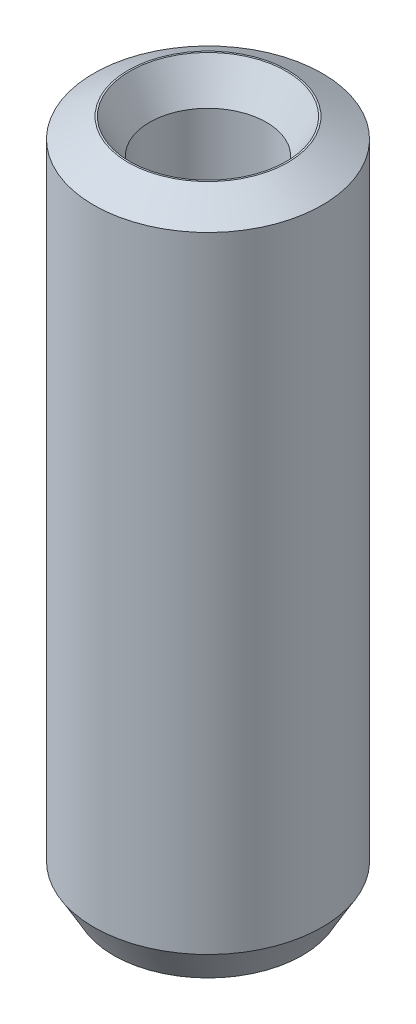
ISO-10303-21;
HEADER;
FILE_DESCRIPTION(('STEP AP214'),'2;1');
FILE_NAME('part.step','',(''),(''),'','','');
FILE_SCHEMA(('AUTOMOTIVE_DESIGN { 1 0 10303 214 1 1 1 1 }'));
ENDSEC;
DATA;
#1=APPLICATION_CONTEXT('core data for automotive mechanical design processes');
#2=APPLICATION_PROTOCOL_DEFINITION('international standard','automotive_design',2000,#1);
#3=PRODUCT_CONTEXT('',#1,'mechanical');
#4=PRODUCT('Part','Part','',(#3));
#5=PRODUCT_RELATED_PRODUCT_CATEGORY('part','',(#4));
#6=PRODUCT_DEFINITION_FORMATION('','',#4);
#7=PRODUCT_DEFINITION_CONTEXT('part definition',#1,'design');
#8=PRODUCT_DEFINITION('design','',#6,#7);
#9=PRODUCT_DEFINITION_SHAPE('','',#8);
#10=(LENGTH_UNIT() NAMED_UNIT(*) SI_UNIT(.MILLI.,.METRE.));
#11=(NAMED_UNIT(*) PLANE_ANGLE_UNIT() SI_UNIT($,.RADIAN.));
#12=(NAMED_UNIT(*) SI_UNIT($,.STERADIAN.) SOLID_ANGLE_UNIT());
#13=UNCERTAINTY_MEASURE_WITH_UNIT(LENGTH_MEASURE(1.E-05),#10,'distance_accuracy_value','');
#14=(GEOMETRIC_REPRESENTATION_CONTEXT(3) GLOBAL_UNCERTAINTY_ASSIGNED_CONTEXT((#13)) GLOBAL_UNIT_ASSIGNED_CONTEXT((#10,
#11,#12)) REPRESENTATION_CONTEXT('',''));
#15=CARTESIAN_POINT('',(0.,0.,0.));
#16=DIRECTION('',(0.,0.,1.));
#17=DIRECTION('',(1.,0.,0.));
#18=AXIS2_PLACEMENT_3D('',#15,#16,#17);
#19=CARTESIAN_POINT('',(0.,89.2215520016744,0.));
#20=DIRECTION('',(0.,-1.,0.));
#21=DIRECTION('',(0.,0.,-1.));
#22=AXIS2_PLACEMENT_3D('',#19,#20,#21);
#23=CYLINDRICAL_SURFACE('',#22,15.);
#24=CARTESIAN_POINT('',(0.,4.50780103770008,0.));
#25=DIRECTION('',(0.,1.,0.));
#26=DIRECTION('',(0.,0.,1.));
#27=AXIS2_PLACEMENT_3D('',#24,#25,#26);
#28=CIRCLE('',#27,15.);
#29=CARTESIAN_POINT('',(0.,4.50780103770008,15.));
#30=VERTEX_POINT('',#29);
#31=EDGE_CURVE('E10',#30,#30,#28,.T.);
#32=ORIENTED_EDGE('',*,*,#31,.T.);
#33=EDGE_LOOP('',(#32));
#34=FACE_BOUND('',#33,.T.);
#35=CARTESIAN_POINT('',(0.,86.6189718591049,0.));
#36=DIRECTION('',(0.,1.,0.));
#37=DIRECTION('',(0.,0.,1.));
#38=AXIS2_PLACEMENT_3D('',#35,#36,#37);
#39=CIRCLE('',#38,15.);
#40=CARTESIAN_POINT('',(0.,86.6189718591049,15.));
#41=VERTEX_POINT('',#40);
#42=EDGE_CURVE('E50',#41,#41,#39,.F.);
#43=ORIENTED_EDGE('',*,*,#42,.T.);
#44=EDGE_LOOP('',(#43));
#45=FACE_BOUND('',#44,.T.);
#46=ADVANCED_FACE('F39',(#34,#45),#23,.T.);
#47=CARTESIAN_POINT('',(0.,89.2215520016744,0.));
#48=DIRECTION('',(0.,1.,0.));
#49=DIRECTION('',(0.,0.,1.));
#50=AXIS2_PLACEMENT_3D('',#47,#48,#49);
#51=PLANE('',#50);
#52=CARTESIAN_POINT('',(0.,89.2215520016744,0.));
#53=DIRECTION('',(0.,1.,0.));
#54=DIRECTION('',(0.,0.,1.));
#55=AXIS2_PLACEMENT_3D('',#52,#53,#54);
#56=CIRCLE('',#55,10.2772388732367);
#57=CARTESIAN_POINT('',(0.,89.2215520016744,10.2772388732367));
#58=VERTEX_POINT('',#57);
#59=EDGE_CURVE('E58',#58,#58,#56,.F.);
#60=ORIENTED_EDGE('',*,*,#59,.T.);
#61=EDGE_LOOP('',(#60));
#62=FACE_BOUND('',#61,.T.);
#63=CARTESIAN_POINT('',(0.,89.2215520016744,0.));
#64=DIRECTION('',(0.,1.,0.));
#65=DIRECTION('',(0.,0.,1.));
#66=AXIS2_PLACEMENT_3D('',#63,#64,#65);
#67=CIRCLE('',#66,10.4921989622999);
#68=CARTESIAN_POINT('',(0.,89.2215520016744,10.4921989622999));
#69=VERTEX_POINT('',#68);
#70=EDGE_CURVE('E61',#69,#69,#67,.T.);
#71=ORIENTED_EDGE('',*,*,#70,.T.);
#72=EDGE_LOOP('',(#71));
#73=FACE_BOUND('',#72,.T.);
#74=ADVANCED_FACE('F88',(#62,#73),#51,.T.);
#75=CARTESIAN_POINT('',(0.,0.,0.));
#76=DIRECTION('',(0.,1.,0.));
#77=DIRECTION('',(0.,0.,1.));
#78=AXIS2_PLACEMENT_3D('',#75,#76,#77);
#79=PLANE('',#78);
#80=CARTESIAN_POINT('',(0.,0.,0.));
#81=DIRECTION('',(0.,1.,0.));
#82=DIRECTION('',(0.,0.,1.));
#83=AXIS2_PLACEMENT_3D('',#80,#81,#82);
#84=CIRCLE('',#83,12.1824597683673);
#85=CARTESIAN_POINT('',(0.,0.,12.1824597683673));
#86=VERTEX_POINT('',#85);
#87=EDGE_CURVE('E51',#86,#86,#84,.T.);
#88=ORIENTED_EDGE('',*,*,#87,.T.);
#89=EDGE_LOOP('',(#88));
#90=FACE_BOUND('',#89,.T.);
#91=CARTESIAN_POINT('',(0.,0.,0.));
#92=DIRECTION('',(0.,1.,0.));
#93=DIRECTION('',(0.,0.,1.));
#94=AXIS2_PLACEMENT_3D('',#91,#92,#93);
#95=CIRCLE('',#94,12.3974198574306);
#96=CARTESIAN_POINT('',(0.,0.,12.3974198574306));
#97=VERTEX_POINT('',#96);
#98=EDGE_CURVE('E54',#97,#97,#95,.F.);
#99=ORIENTED_EDGE('',*,*,#98,.T.);
#100=EDGE_LOOP('',(#99));
#101=FACE_BOUND('',#100,.T.);
#102=ADVANCED_FACE('F83',(#90,#101),#79,.F.);
#103=CARTESIAN_POINT('',(0.,89.2215520016744,0.));
#104=DIRECTION('',(0.,-1.,0.));
#105=DIRECTION('',(0.,0.,-1.));
#106=AXIS2_PLACEMENT_3D('',#103,#104,#105);
#107=CYLINDRICAL_SURFACE('',#106,7.67465873066726);
#108=CARTESIAN_POINT('',(0.,84.7137509639743,0.));
#109=DIRECTION('',(0.,1.,0.));
#110=DIRECTION('',(0.,0.,1.));
#111=AXIS2_PLACEMENT_3D('',#108,#109,#110);
#112=CIRCLE('',#111,7.67465873066726);
#113=CARTESIAN_POINT('',(0.,84.7137509639743,7.67465873066726));
#114=VERTEX_POINT('',#113);
#115=EDGE_CURVE('E67',#114,#114,#112,.T.);
#116=ORIENTED_EDGE('',*,*,#115,.T.);
#117=EDGE_LOOP('',(#116));
#118=FACE_BOUND('',#117,.T.);
#119=CARTESIAN_POINT('',(0.,2.60258014256944,0.));
#120=DIRECTION('',(0.,1.,0.));
#121=DIRECTION('',(0.,0.,1.));
#122=AXIS2_PLACEMENT_3D('',#119,#120,#121);
#123=CIRCLE('',#122,7.67465873066726);
#124=CARTESIAN_POINT('',(0.,2.60258014256944,7.67465873066726));
#125=VERTEX_POINT('',#124);
#126=EDGE_CURVE('E69',#125,#125,#123,.F.);
#127=ORIENTED_EDGE('',*,*,#126,.T.);
#128=EDGE_LOOP('',(#127));
#129=FACE_BOUND('',#128,.T.);
#130=ADVANCED_FACE('F71',(#118,#129),#107,.F.);
#131=CARTESIAN_POINT('',(0.,84.7137509639743,0.));
#132=DIRECTION('',(0.,1.,0.));
#133=DIRECTION('',(0.,0.,1.));
#134=AXIS2_PLACEMENT_3D('',#131,#132,#133);
#135=CONICAL_SURFACE('',#134,7.67465873066726,0.523598775598305);
#136=ORIENTED_EDGE('',*,*,#59,.F.);
#137=EDGE_LOOP('',(#136));
#138=FACE_BOUND('',#137,.T.);
#139=ORIENTED_EDGE('',*,*,#115,.F.);
#140=EDGE_LOOP('',(#139));
#141=FACE_BOUND('',#140,.T.);
#142=ADVANCED_FACE('F77',(#138,#141),#135,.F.);
#143=CARTESIAN_POINT('',(0.,0.,0.));
#144=DIRECTION('',(0.,-1.,0.));
#145=DIRECTION('',(0.,0.,-1.));
#146=AXIS2_PLACEMENT_3D('',#143,#144,#145);
#147=CONICAL_SURFACE('',#146,12.1824597683673,1.0471975511966);
#148=ORIENTED_EDGE('',*,*,#126,.F.);
#149=EDGE_LOOP('',(#148));
#150=FACE_BOUND('',#149,.T.);
#151=ORIENTED_EDGE('',*,*,#87,.F.);
#152=EDGE_LOOP('',(#151));
#153=FACE_BOUND('',#152,.T.);
#154=ADVANCED_FACE('F73',(#150,#153),#147,.F.);
#155=CARTESIAN_POINT('',(0.,4.50780103770008,0.));
#156=DIRECTION('',(0.,1.,0.));
#157=DIRECTION('',(0.,0.,1.));
#158=AXIS2_PLACEMENT_3D('',#155,#156,#157);
#159=CONICAL_SURFACE('',#158,15.,0.523598775598304);
#160=ORIENTED_EDGE('',*,*,#98,.F.);
#161=EDGE_LOOP('',(#160));
#162=FACE_BOUND('',#161,.T.);
#163=ORIENTED_EDGE('',*,*,#31,.F.);
#164=EDGE_LOOP('',(#163));
#165=FACE_BOUND('',#164,.T.);
#166=ADVANCED_FACE('F76',(#162,#165),#159,.T.);
#167=CARTESIAN_POINT('',(0.,89.2215520016744,0.));
#168=DIRECTION('',(0.,-1.,0.));
#169=DIRECTION('',(0.,0.,-1.));
#170=AXIS2_PLACEMENT_3D('',#167,#168,#169);
#171=CONICAL_SURFACE('',#170,10.4921989622999,1.04719755119659);
#172=ORIENTED_EDGE('',*,*,#42,.F.);
#173=EDGE_LOOP('',(#172));
#174=FACE_BOUND('',#173,.T.);
#175=ORIENTED_EDGE('',*,*,#70,.F.);
#176=EDGE_LOOP('',(#175));
#177=FACE_BOUND('',#176,.T.);
#178=ADVANCED_FACE('F45',(#174,#177),#171,.T.);
#179=CLOSED_SHELL('',(#46,#74,#102,#130,#142,#154,#166,#178));
#180=MANIFOLD_SOLID_BREP('B2',#179);
#181=ADVANCED_BREP_SHAPE_REPRESENTATION('',(#18,#180),#14);
#182=SHAPE_DEFINITION_REPRESENTATION(#9,#181);
ENDSEC;
END-ISO-10303-21;
